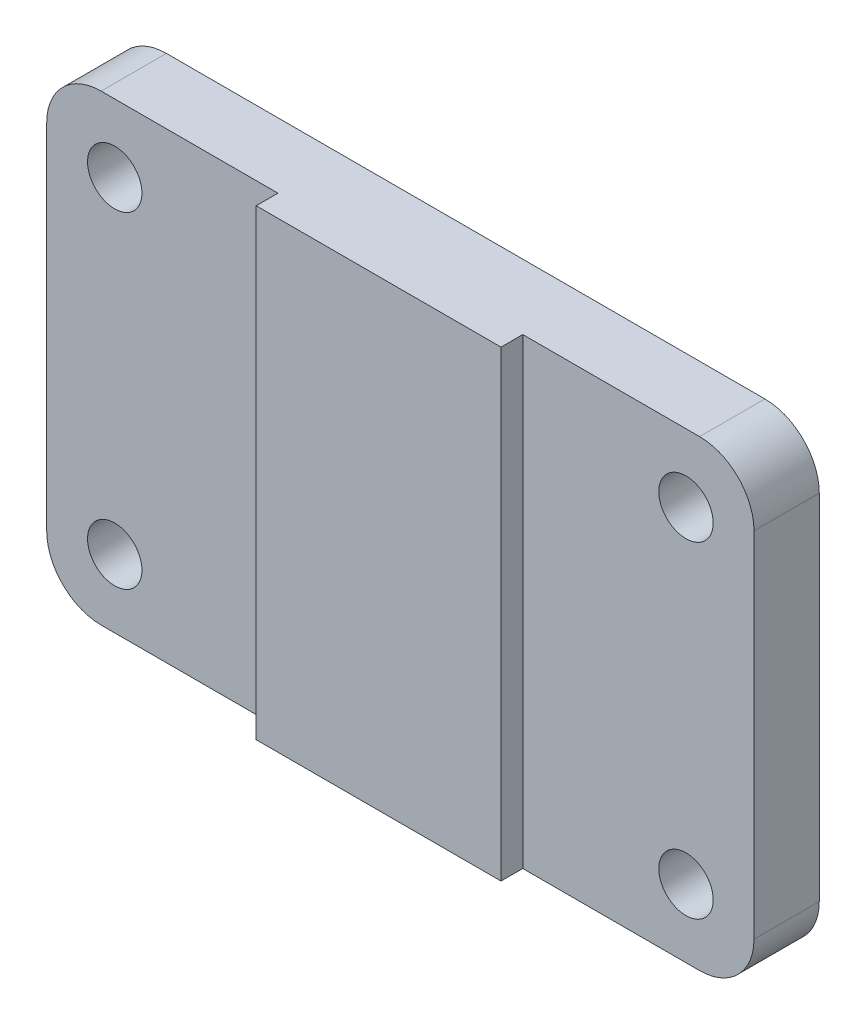
ISO-10303-21;
HEADER;
FILE_DESCRIPTION(('STEP AP214'),'2;1');
FILE_NAME('part.step','',(''),(''),'','','');
FILE_SCHEMA(('AUTOMOTIVE_DESIGN { 1 0 10303 214 1 1 1 1 }'));
ENDSEC;
DATA;
#1=APPLICATION_CONTEXT('core data for automotive mechanical design processes');
#2=APPLICATION_PROTOCOL_DEFINITION('international standard','automotive_design',2000,#1);
#3=PRODUCT_CONTEXT('',#1,'mechanical');
#4=PRODUCT('Part','Part','',(#3));
#5=PRODUCT_RELATED_PRODUCT_CATEGORY('part','',(#4));
#6=PRODUCT_DEFINITION_FORMATION('','',#4);
#7=PRODUCT_DEFINITION_CONTEXT('part definition',#1,'design');
#8=PRODUCT_DEFINITION('design','',#6,#7);
#9=PRODUCT_DEFINITION_SHAPE('','',#8);
#10=(LENGTH_UNIT() NAMED_UNIT(*) SI_UNIT(.MILLI.,.METRE.));
#11=(NAMED_UNIT(*) PLANE_ANGLE_UNIT() SI_UNIT($,.RADIAN.));
#12=(NAMED_UNIT(*) SI_UNIT($,.STERADIAN.) SOLID_ANGLE_UNIT());
#13=UNCERTAINTY_MEASURE_WITH_UNIT(LENGTH_MEASURE(1.E-05),#10,'distance_accuracy_value','');
#14=(GEOMETRIC_REPRESENTATION_CONTEXT(3) GLOBAL_UNCERTAINTY_ASSIGNED_CONTEXT((#13)) GLOBAL_UNIT_ASSIGNED_CONTEXT((#10,
#11,#12)) REPRESENTATION_CONTEXT('',''));
#15=CARTESIAN_POINT('',(0.,0.,0.));
#16=DIRECTION('',(0.,0.,1.));
#17=DIRECTION('',(1.,0.,0.));
#18=AXIS2_PLACEMENT_3D('',#15,#16,#17);
#19=CARTESIAN_POINT('',(22.5,85.,16.));
#20=DIRECTION('',(0.,0.,-1.));
#21=DIRECTION('',(-1.,0.,0.));
#22=AXIS2_PLACEMENT_3D('',#19,#20,#21);
#23=PLANE('',#22);
#24=DIRECTION('',(1.,0.,0.));
#25=VECTOR('',#24,1.);
#26=CARTESIAN_POINT('',(22.5,0.,16.));
#27=LINE('',#26,#25);
#28=CARTESIAN_POINT('',(-22.5,0.,16.));
#29=VERTEX_POINT('',#28);
#30=CARTESIAN_POINT('',(22.5,0.,16.));
#31=VERTEX_POINT('',#30);
#32=EDGE_CURVE('E176',#29,#31,#27,.T.);
#33=ORIENTED_EDGE('',*,*,#32,.T.);
#34=DIRECTION('',(0.,-1.,0.));
#35=VECTOR('',#34,1.);
#36=CARTESIAN_POINT('',(22.5,85.,16.));
#37=LINE('',#36,#35);
#38=CARTESIAN_POINT('',(22.5,85.,16.));
#39=VERTEX_POINT('',#38);
#40=EDGE_CURVE('E204',#39,#31,#37,.T.);
#41=ORIENTED_EDGE('',*,*,#40,.F.);
#42=DIRECTION('',(1.,0.,0.));
#43=VECTOR('',#42,1.);
#44=CARTESIAN_POINT('',(22.5,85.,16.));
#45=LINE('',#44,#43);
#46=CARTESIAN_POINT('',(-22.5,85.,16.));
#47=VERTEX_POINT('',#46);
#48=EDGE_CURVE('E177',#47,#39,#45,.T.);
#49=ORIENTED_EDGE('',*,*,#48,.F.);
#50=DIRECTION('',(0.,-1.,0.));
#51=VECTOR('',#50,1.);
#52=CARTESIAN_POINT('',(-22.5,85.,16.));
#53=LINE('',#52,#51);
#54=EDGE_CURVE('E143',#47,#29,#53,.T.);
#55=ORIENTED_EDGE('',*,*,#54,.T.);
#56=EDGE_LOOP('',(#33,#41,#49,#55));
#57=FACE_BOUND('',#56,.T.);
#58=ADVANCED_FACE('F43',(#57),#23,.F.);
#59=CARTESIAN_POINT('',(22.5,85.,12.));
#60=DIRECTION('',(-1.,0.,0.));
#61=DIRECTION('',(0.,0.,1.));
#62=AXIS2_PLACEMENT_3D('',#59,#60,#61);
#63=PLANE('',#62);
#64=DIRECTION('',(0.,0.,-1.));
#65=VECTOR('',#64,1.);
#66=CARTESIAN_POINT('',(22.5,0.,12.));
#67=LINE('',#66,#65);
#68=CARTESIAN_POINT('',(22.5,0.,12.));
#69=VERTEX_POINT('',#68);
#70=EDGE_CURVE('E189',#31,#69,#67,.T.);
#71=ORIENTED_EDGE('',*,*,#70,.T.);
#72=DIRECTION('',(0.,-1.,0.));
#73=VECTOR('',#72,1.);
#74=CARTESIAN_POINT('',(22.5,85.,12.));
#75=LINE('',#74,#73);
#76=CARTESIAN_POINT('',(22.5,85.,12.));
#77=VERTEX_POINT('',#76);
#78=EDGE_CURVE('E201',#77,#69,#75,.T.);
#79=ORIENTED_EDGE('',*,*,#78,.F.);
#80=DIRECTION('',(0.,0.,-1.));
#81=VECTOR('',#80,1.);
#82=CARTESIAN_POINT('',(22.5,85.,12.));
#83=LINE('',#82,#81);
#84=EDGE_CURVE('E179',#39,#77,#83,.T.);
#85=ORIENTED_EDGE('',*,*,#84,.F.);
#86=ORIENTED_EDGE('',*,*,#40,.T.);
#87=EDGE_LOOP('',(#71,#79,#85,#86));
#88=FACE_BOUND('',#87,.T.);
#89=ADVANCED_FACE('F273',(#88),#63,.F.);
#90=CARTESIAN_POINT('',(65.,85.,12.));
#91=DIRECTION('',(0.,0.,-1.));
#92=DIRECTION('',(-1.,0.,0.));
#93=AXIS2_PLACEMENT_3D('',#90,#91,#92);
#94=PLANE('',#93);
#95=CARTESIAN_POINT('',(52.5,12.5,12.));
#96=DIRECTION('',(0.,0.,1.));
#97=DIRECTION('',(1.,0.,0.));
#98=AXIS2_PLACEMENT_3D('',#95,#96,#97);
#99=CIRCLE('',#98,4.99999999999999);
#100=CARTESIAN_POINT('',(57.5,12.5,12.));
#101=VERTEX_POINT('',#100);
#102=EDGE_CURVE('E164',#101,#101,#99,.T.);
#103=ORIENTED_EDGE('',*,*,#102,.F.);
#104=EDGE_LOOP('',(#103));
#105=FACE_BOUND('',#104,.T.);
#106=CARTESIAN_POINT('',(52.5,72.5,12.));
#107=DIRECTION('',(0.,0.,1.));
#108=DIRECTION('',(1.,0.,0.));
#109=AXIS2_PLACEMENT_3D('',#106,#107,#108);
#110=CIRCLE('',#109,4.99999999999999);
#111=CARTESIAN_POINT('',(57.5,72.5,12.));
#112=VERTEX_POINT('',#111);
#113=EDGE_CURVE('E170',#112,#112,#110,.T.);
#114=ORIENTED_EDGE('',*,*,#113,.F.);
#115=EDGE_LOOP('',(#114));
#116=FACE_BOUND('',#115,.T.);
#117=DIRECTION('',(0.,-1.,0.));
#118=VECTOR('',#117,1.);
#119=CARTESIAN_POINT('',(65.,85.,12.));
#120=LINE('',#119,#118);
#121=CARTESIAN_POINT('',(65.,75.,12.));
#122=VERTEX_POINT('',#121);
#123=CARTESIAN_POINT('',(65.,9.99999999999999,12.));
#124=VERTEX_POINT('',#123);
#125=EDGE_CURVE('E198',#122,#124,#120,.T.);
#126=ORIENTED_EDGE('',*,*,#125,.F.);
#127=CARTESIAN_POINT('',(55.,75.,12.));
#128=DIRECTION('',(0.,0.,-1.));
#129=DIRECTION('',(-1.,0.,0.));
#130=AXIS2_PLACEMENT_3D('',#127,#128,#129);
#131=CIRCLE('',#130,10.);
#132=CARTESIAN_POINT('',(55.,85.,12.));
#133=VERTEX_POINT('',#132);
#134=EDGE_CURVE('E221',#122,#133,#131,.F.);
#135=ORIENTED_EDGE('',*,*,#134,.T.);
#136=DIRECTION('',(1.,0.,0.));
#137=VECTOR('',#136,1.);
#138=CARTESIAN_POINT('',(65.,85.,12.));
#139=LINE('',#138,#137);
#140=EDGE_CURVE('E182',#77,#133,#139,.T.);
#141=ORIENTED_EDGE('',*,*,#140,.F.);
#142=ORIENTED_EDGE('',*,*,#78,.T.);
#143=DIRECTION('',(1.,0.,0.));
#144=VECTOR('',#143,1.);
#145=CARTESIAN_POINT('',(65.,0.,12.));
#146=LINE('',#145,#144);
#147=CARTESIAN_POINT('',(55.,0.,12.));
#148=VERTEX_POINT('',#147);
#149=EDGE_CURVE('E191',#69,#148,#146,.T.);
#150=ORIENTED_EDGE('',*,*,#149,.T.);
#151=CARTESIAN_POINT('',(55.,9.99999999999999,12.));
#152=DIRECTION('',(0.,0.,-1.));
#153=DIRECTION('',(-1.,0.,0.));
#154=AXIS2_PLACEMENT_3D('',#151,#152,#153);
#155=CIRCLE('',#154,10.);
#156=EDGE_CURVE('E219',#148,#124,#155,.F.);
#157=ORIENTED_EDGE('',*,*,#156,.T.);
#158=EDGE_LOOP('',(#126,#135,#141,#142,#150,#157));
#159=FACE_BOUND('',#158,.T.);
#160=ADVANCED_FACE('F279',(#105,#116,#159),#94,.F.);
#161=CARTESIAN_POINT('',(65.,85.,0.));
#162=DIRECTION('',(-1.,0.,0.));
#163=DIRECTION('',(0.,0.,1.));
#164=AXIS2_PLACEMENT_3D('',#161,#162,#163);
#165=PLANE('',#164);
#166=DIRECTION('',(0.,-1.,0.));
#167=VECTOR('',#166,1.);
#168=CARTESIAN_POINT('',(65.,85.,0.));
#169=LINE('',#168,#167);
#170=CARTESIAN_POINT('',(65.,75.,0.));
#171=VERTEX_POINT('',#170);
#172=CARTESIAN_POINT('',(65.,9.99999999999999,0.));
#173=VERTEX_POINT('',#172);
#174=EDGE_CURVE('E187',#171,#173,#169,.T.);
#175=ORIENTED_EDGE('',*,*,#174,.F.);
#176=DIRECTION('',(0.,0.,-1.));
#177=VECTOR('',#176,1.);
#178=CARTESIAN_POINT('',(65.,75.,0.));
#179=LINE('',#178,#177);
#180=EDGE_CURVE('E217',#171,#122,#179,.F.);
#181=ORIENTED_EDGE('',*,*,#180,.T.);
#182=ORIENTED_EDGE('',*,*,#125,.T.);
#183=DIRECTION('',(0.,0.,-1.));
#184=VECTOR('',#183,1.);
#185=CARTESIAN_POINT('',(65.,9.99999999999999,0.));
#186=LINE('',#185,#184);
#187=EDGE_CURVE('E214',#124,#173,#186,.T.);
#188=ORIENTED_EDGE('',*,*,#187,.T.);
#189=EDGE_LOOP('',(#175,#181,#182,#188));
#190=FACE_BOUND('',#189,.T.);
#191=ADVANCED_FACE('F254',(#190),#165,.F.);
#192=CARTESIAN_POINT('',(0.,85.,0.));
#193=DIRECTION('',(0.,0.,1.));
#194=DIRECTION('',(1.,0.,0.));
#195=AXIS2_PLACEMENT_3D('',#192,#193,#194);
#196=PLANE('',#195);
#197=CARTESIAN_POINT('',(-52.5,12.5,0.));
#198=DIRECTION('',(0.,0.,1.));
#199=DIRECTION('',(1.,0.,0.));
#200=AXIS2_PLACEMENT_3D('',#197,#198,#199);
#201=CIRCLE('',#200,5.);
#202=CARTESIAN_POINT('',(-47.5,12.5,0.));
#203=VERTEX_POINT('',#202);
#204=EDGE_CURVE('E521',#203,#203,#201,.T.);
#205=ORIENTED_EDGE('',*,*,#204,.T.);
#206=EDGE_LOOP('',(#205));
#207=FACE_BOUND('',#206,.T.);
#208=CARTESIAN_POINT('',(-52.5,72.5,0.));
#209=DIRECTION('',(0.,0.,1.));
#210=DIRECTION('',(1.,0.,0.));
#211=AXIS2_PLACEMENT_3D('',#208,#209,#210);
#212=CIRCLE('',#211,5.);
#213=CARTESIAN_POINT('',(-47.5,72.5,0.));
#214=VERTEX_POINT('',#213);
#215=EDGE_CURVE('E158',#214,#214,#212,.T.);
#216=ORIENTED_EDGE('',*,*,#215,.T.);
#217=EDGE_LOOP('',(#216));
#218=FACE_BOUND('',#217,.T.);
#219=CARTESIAN_POINT('',(52.5,12.5,0.));
#220=DIRECTION('',(0.,0.,1.));
#221=DIRECTION('',(1.,0.,0.));
#222=AXIS2_PLACEMENT_3D('',#219,#220,#221);
#223=CIRCLE('',#222,5.);
#224=CARTESIAN_POINT('',(57.5,12.5,0.));
#225=VERTEX_POINT('',#224);
#226=EDGE_CURVE('E167',#225,#225,#223,.T.);
#227=ORIENTED_EDGE('',*,*,#226,.T.);
#228=EDGE_LOOP('',(#227));
#229=FACE_BOUND('',#228,.T.);
#230=CARTESIAN_POINT('',(52.5,72.5,0.));
#231=DIRECTION('',(0.,0.,1.));
#232=DIRECTION('',(1.,0.,0.));
#233=AXIS2_PLACEMENT_3D('',#230,#231,#232);
#234=CIRCLE('',#233,5.);
#235=CARTESIAN_POINT('',(57.5,72.5,0.));
#236=VERTEX_POINT('',#235);
#237=EDGE_CURVE('E173',#236,#236,#234,.T.);
#238=ORIENTED_EDGE('',*,*,#237,.T.);
#239=EDGE_LOOP('',(#238));
#240=FACE_BOUND('',#239,.T.);
#241=DIRECTION('',(0.,-1.,0.));
#242=VECTOR('',#241,1.);
#243=CARTESIAN_POINT('',(-65.,85.,0.));
#244=LINE('',#243,#242);
#245=CARTESIAN_POINT('',(-65.,75.,0.));
#246=VERTEX_POINT('',#245);
#247=CARTESIAN_POINT('',(-65.,9.99999999999999,0.));
#248=VERTEX_POINT('',#247);
#249=EDGE_CURVE('E161',#246,#248,#244,.T.);
#250=ORIENTED_EDGE('',*,*,#249,.F.);
#251=CARTESIAN_POINT('',(-55.,75.,0.));
#252=DIRECTION('',(0.,0.,1.));
#253=DIRECTION('',(1.,0.,0.));
#254=AXIS2_PLACEMENT_3D('',#251,#252,#253);
#255=CIRCLE('',#254,10.);
#256=CARTESIAN_POINT('',(-55.,85.,0.));
#257=VERTEX_POINT('',#256);
#258=EDGE_CURVE('E232',#246,#257,#255,.F.);
#259=ORIENTED_EDGE('',*,*,#258,.T.);
#260=DIRECTION('',(-1.,0.,0.));
#261=VECTOR('',#260,1.);
#262=CARTESIAN_POINT('',(0.,85.,0.));
#263=LINE('',#262,#261);
#264=CARTESIAN_POINT('',(55.,85.,0.));
#265=VERTEX_POINT('',#264);
#266=EDGE_CURVE('E185',#265,#257,#263,.T.);
#267=ORIENTED_EDGE('',*,*,#266,.F.);
#268=CARTESIAN_POINT('',(55.,75.,0.));
#269=DIRECTION('',(0.,0.,1.));
#270=DIRECTION('',(1.,0.,0.));
#271=AXIS2_PLACEMENT_3D('',#268,#269,#270);
#272=CIRCLE('',#271,10.);
#273=EDGE_CURVE('E212',#265,#171,#272,.F.);
#274=ORIENTED_EDGE('',*,*,#273,.T.);
#275=ORIENTED_EDGE('',*,*,#174,.T.);
#276=CARTESIAN_POINT('',(55.,9.99999999999999,0.));
#277=DIRECTION('',(0.,0.,1.));
#278=DIRECTION('',(1.,0.,0.));
#279=AXIS2_PLACEMENT_3D('',#276,#277,#278);
#280=CIRCLE('',#279,10.);
#281=CARTESIAN_POINT('',(55.,0.,0.));
#282=VERTEX_POINT('',#281);
#283=EDGE_CURVE('E210',#173,#282,#280,.F.);
#284=ORIENTED_EDGE('',*,*,#283,.T.);
#285=DIRECTION('',(-1.,0.,0.));
#286=VECTOR('',#285,1.);
#287=CARTESIAN_POINT('',(0.,0.,0.));
#288=LINE('',#287,#286);
#289=CARTESIAN_POINT('',(-55.,0.,0.));
#290=VERTEX_POINT('',#289);
#291=EDGE_CURVE('E180',#282,#290,#288,.T.);
#292=ORIENTED_EDGE('',*,*,#291,.T.);
#293=CARTESIAN_POINT('',(-55.,10.,0.));
#294=DIRECTION('',(0.,0.,1.));
#295=DIRECTION('',(1.,0.,0.));
#296=AXIS2_PLACEMENT_3D('',#293,#294,#295);
#297=CIRCLE('',#296,10.);
#298=EDGE_CURVE('E230',#290,#248,#297,.F.);
#299=ORIENTED_EDGE('',*,*,#298,.T.);
#300=EDGE_LOOP('',(#250,#259,#267,#274,#275,#284,#292,#299));
#301=FACE_BOUND('',#300,.T.);
#302=ADVANCED_FACE('F245',(#207,#218,#229,#240,#301),#196,.F.);
#303=CARTESIAN_POINT('',(0.,85.,0.));
#304=DIRECTION('',(0.,-1.,0.));
#305=DIRECTION('',(0.,0.,-1.));
#306=AXIS2_PLACEMENT_3D('',#303,#304,#305);
#307=PLANE('',#306);
#308=ORIENTED_EDGE('',*,*,#266,.T.);
#309=DIRECTION('',(0.,0.,-1.));
#310=VECTOR('',#309,1.);
#311=CARTESIAN_POINT('',(-55.,85.,12.));
#312=LINE('',#311,#310);
#313=CARTESIAN_POINT('',(-55.,85.,12.));
#314=VERTEX_POINT('',#313);
#315=EDGE_CURVE('E66',#257,#314,#312,.F.);
#316=ORIENTED_EDGE('',*,*,#315,.T.);
#317=DIRECTION('',(-1.,0.,0.));
#318=VECTOR('',#317,1.);
#319=CARTESIAN_POINT('',(-65.,85.,12.));
#320=LINE('',#319,#318);
#321=CARTESIAN_POINT('',(-22.5,85.,12.));
#322=VERTEX_POINT('',#321);
#323=EDGE_CURVE('E135',#322,#314,#320,.T.);
#324=ORIENTED_EDGE('',*,*,#323,.F.);
#325=DIRECTION('',(0.,0.,-1.));
#326=VECTOR('',#325,1.);
#327=CARTESIAN_POINT('',(-22.5,85.,12.));
#328=LINE('',#327,#326);
#329=EDGE_CURVE('E147',#47,#322,#328,.T.);
#330=ORIENTED_EDGE('',*,*,#329,.F.);
#331=ORIENTED_EDGE('',*,*,#48,.T.);
#332=ORIENTED_EDGE('',*,*,#84,.T.);
#333=ORIENTED_EDGE('',*,*,#140,.T.);
#334=DIRECTION('',(0.,0.,-1.));
#335=VECTOR('',#334,1.);
#336=CARTESIAN_POINT('',(55.,85.,0.));
#337=LINE('',#336,#335);
#338=EDGE_CURVE('E207',#133,#265,#337,.T.);
#339=ORIENTED_EDGE('',*,*,#338,.T.);
#340=EDGE_LOOP('',(#308,#316,#324,#330,#331,#332,#333,#339));
#341=FACE_BOUND('',#340,.T.);
#342=ADVANCED_FACE('F146',(#341),#307,.F.);
#343=CARTESIAN_POINT('',(0.,0.,0.));
#344=DIRECTION('',(0.,-1.,0.));
#345=DIRECTION('',(0.,0.,-1.));
#346=AXIS2_PLACEMENT_3D('',#343,#344,#345);
#347=PLANE('',#346);
#348=DIRECTION('',(-1.,0.,0.));
#349=VECTOR('',#348,1.);
#350=CARTESIAN_POINT('',(-65.,0.,12.));
#351=LINE('',#350,#349);
#352=CARTESIAN_POINT('',(-22.5,0.,12.));
#353=VERTEX_POINT('',#352);
#354=CARTESIAN_POINT('',(-55.,0.,12.));
#355=VERTEX_POINT('',#354);
#356=EDGE_CURVE('E137',#353,#355,#351,.T.);
#357=ORIENTED_EDGE('',*,*,#356,.T.);
#358=DIRECTION('',(0.,0.,-1.));
#359=VECTOR('',#358,1.);
#360=CARTESIAN_POINT('',(-55.,0.,0.));
#361=LINE('',#360,#359);
#362=EDGE_CURVE('E11',#355,#290,#361,.T.);
#363=ORIENTED_EDGE('',*,*,#362,.T.);
#364=ORIENTED_EDGE('',*,*,#291,.F.);
#365=DIRECTION('',(0.,0.,-1.));
#366=VECTOR('',#365,1.);
#367=CARTESIAN_POINT('',(55.,0.,12.));
#368=LINE('',#367,#366);
#369=EDGE_CURVE('E223',#282,#148,#368,.F.);
#370=ORIENTED_EDGE('',*,*,#369,.T.);
#371=ORIENTED_EDGE('',*,*,#149,.F.);
#372=ORIENTED_EDGE('',*,*,#70,.F.);
#373=ORIENTED_EDGE('',*,*,#32,.F.);
#374=DIRECTION('',(0.,0.,-1.));
#375=VECTOR('',#374,1.);
#376=CARTESIAN_POINT('',(-22.5,0.,12.));
#377=LINE('',#376,#375);
#378=EDGE_CURVE('E148',#29,#353,#377,.T.);
#379=ORIENTED_EDGE('',*,*,#378,.T.);
#380=EDGE_LOOP('',(#357,#363,#364,#370,#371,#372,#373,#379));
#381=FACE_BOUND('',#380,.T.);
#382=ADVANCED_FACE('F263',(#381),#347,.T.);
#383=CARTESIAN_POINT('',(52.5,72.5,12.));
#384=DIRECTION('',(0.,0.,1.));
#385=DIRECTION('',(1.,0.,0.));
#386=AXIS2_PLACEMENT_3D('',#383,#384,#385);
#387=CYLINDRICAL_SURFACE('',#386,4.99999999999999);
#388=ORIENTED_EDGE('',*,*,#237,.F.);
#389=EDGE_LOOP('',(#388));
#390=FACE_BOUND('',#389,.T.);
#391=ORIENTED_EDGE('',*,*,#113,.T.);
#392=EDGE_LOOP('',(#391));
#393=FACE_BOUND('',#392,.T.);
#394=ADVANCED_FACE('F301',(#390,#393),#387,.F.);
#395=CARTESIAN_POINT('',(52.5,12.5,12.));
#396=DIRECTION('',(0.,0.,1.));
#397=DIRECTION('',(1.,0.,0.));
#398=AXIS2_PLACEMENT_3D('',#395,#396,#397);
#399=CYLINDRICAL_SURFACE('',#398,4.99999999999999);
#400=ORIENTED_EDGE('',*,*,#226,.F.);
#401=EDGE_LOOP('',(#400));
#402=FACE_BOUND('',#401,.T.);
#403=ORIENTED_EDGE('',*,*,#102,.T.);
#404=EDGE_LOOP('',(#403));
#405=FACE_BOUND('',#404,.T.);
#406=ADVANCED_FACE('F286',(#402,#405),#399,.F.);
#407=CARTESIAN_POINT('',(55.,75.,0.));
#408=DIRECTION('',(0.,0.,-1.));
#409=DIRECTION('',(-1.,0.,0.));
#410=AXIS2_PLACEMENT_3D('',#407,#408,#409);
#411=CYLINDRICAL_SURFACE('',#410,10.);
#412=ORIENTED_EDGE('',*,*,#134,.F.);
#413=ORIENTED_EDGE('',*,*,#180,.F.);
#414=ORIENTED_EDGE('',*,*,#273,.F.);
#415=ORIENTED_EDGE('',*,*,#338,.F.);
#416=EDGE_LOOP('',(#412,#413,#414,#415));
#417=FACE_BOUND('',#416,.T.);
#418=ADVANCED_FACE('F250',(#417),#411,.T.);
#419=CARTESIAN_POINT('',(55.,9.99999999999999,0.));
#420=DIRECTION('',(0.,0.,1.));
#421=DIRECTION('',(1.,0.,0.));
#422=AXIS2_PLACEMENT_3D('',#419,#420,#421);
#423=CYLINDRICAL_SURFACE('',#422,10.);
#424=ORIENTED_EDGE('',*,*,#156,.F.);
#425=ORIENTED_EDGE('',*,*,#369,.F.);
#426=ORIENTED_EDGE('',*,*,#283,.F.);
#427=ORIENTED_EDGE('',*,*,#187,.F.);
#428=EDGE_LOOP('',(#424,#425,#426,#427));
#429=FACE_BOUND('',#428,.T.);
#430=ADVANCED_FACE('F259',(#429),#423,.T.);
#431=CARTESIAN_POINT('',(-65.,85.,0.));
#432=DIRECTION('',(-1.,0.,0.));
#433=DIRECTION('',(0.,0.,1.));
#434=AXIS2_PLACEMENT_3D('',#431,#432,#433);
#435=PLANE('',#434);
#436=DIRECTION('',(0.,-1.,0.));
#437=VECTOR('',#436,1.);
#438=CARTESIAN_POINT('',(-65.,85.,12.));
#439=LINE('',#438,#437);
#440=CARTESIAN_POINT('',(-65.,75.,12.));
#441=VERTEX_POINT('',#440);
#442=CARTESIAN_POINT('',(-65.,9.99999999999999,12.));
#443=VERTEX_POINT('',#442);
#444=EDGE_CURVE('E142',#441,#443,#439,.T.);
#445=ORIENTED_EDGE('',*,*,#444,.F.);
#446=DIRECTION('',(0.,0.,-1.));
#447=VECTOR('',#446,1.);
#448=CARTESIAN_POINT('',(-65.,75.,0.));
#449=LINE('',#448,#447);
#450=EDGE_CURVE('E227',#441,#246,#449,.T.);
#451=ORIENTED_EDGE('',*,*,#450,.T.);
#452=ORIENTED_EDGE('',*,*,#249,.T.);
#453=DIRECTION('',(0.,0.,-1.));
#454=VECTOR('',#453,1.);
#455=CARTESIAN_POINT('',(-65.,9.99999999999999,0.));
#456=LINE('',#455,#454);
#457=EDGE_CURVE('E225',#248,#443,#456,.F.);
#458=ORIENTED_EDGE('',*,*,#457,.T.);
#459=EDGE_LOOP('',(#445,#451,#452,#458));
#460=FACE_BOUND('',#459,.T.);
#461=ADVANCED_FACE('F239',(#460),#435,.T.);
#462=CARTESIAN_POINT('',(-65.,85.,12.));
#463=DIRECTION('',(0.,0.,1.));
#464=DIRECTION('',(1.,0.,0.));
#465=AXIS2_PLACEMENT_3D('',#462,#463,#464);
#466=PLANE('',#465);
#467=CARTESIAN_POINT('',(-52.5,12.5,12.));
#468=DIRECTION('',(0.,0.,1.));
#469=DIRECTION('',(1.,0.,0.));
#470=AXIS2_PLACEMENT_3D('',#467,#468,#469);
#471=CIRCLE('',#470,4.99999999999999);
#472=CARTESIAN_POINT('',(-47.5,12.5,12.));
#473=VERTEX_POINT('',#472);
#474=EDGE_CURVE('E524',#473,#473,#471,.T.);
#475=ORIENTED_EDGE('',*,*,#474,.F.);
#476=EDGE_LOOP('',(#475));
#477=FACE_BOUND('',#476,.T.);
#478=CARTESIAN_POINT('',(-52.5,72.5,12.));
#479=DIRECTION('',(0.,0.,1.));
#480=DIRECTION('',(1.,0.,0.));
#481=AXIS2_PLACEMENT_3D('',#478,#479,#480);
#482=CIRCLE('',#481,4.99999999999999);
#483=CARTESIAN_POINT('',(-47.5,72.5,12.));
#484=VERTEX_POINT('',#483);
#485=EDGE_CURVE('E526',#484,#484,#482,.T.);
#486=ORIENTED_EDGE('',*,*,#485,.F.);
#487=EDGE_LOOP('',(#486));
#488=FACE_BOUND('',#487,.T.);
#489=ORIENTED_EDGE('',*,*,#323,.T.);
#490=CARTESIAN_POINT('',(-55.,75.,12.));
#491=DIRECTION('',(0.,0.,1.));
#492=DIRECTION('',(1.,0.,0.));
#493=AXIS2_PLACEMENT_3D('',#490,#491,#492);
#494=CIRCLE('',#493,10.);
#495=EDGE_CURVE('E51',#314,#441,#494,.T.);
#496=ORIENTED_EDGE('',*,*,#495,.T.);
#497=ORIENTED_EDGE('',*,*,#444,.T.);
#498=CARTESIAN_POINT('',(-55.,10.,12.));
#499=DIRECTION('',(0.,0.,1.));
#500=DIRECTION('',(1.,0.,0.));
#501=AXIS2_PLACEMENT_3D('',#498,#499,#500);
#502=CIRCLE('',#501,10.);
#503=EDGE_CURVE('E58',#443,#355,#502,.T.);
#504=ORIENTED_EDGE('',*,*,#503,.T.);
#505=ORIENTED_EDGE('',*,*,#356,.F.);
#506=DIRECTION('',(0.,-1.,0.));
#507=VECTOR('',#506,1.);
#508=CARTESIAN_POINT('',(-22.5,85.,12.));
#509=LINE('',#508,#507);
#510=EDGE_CURVE('E133',#322,#353,#509,.T.);
#511=ORIENTED_EDGE('',*,*,#510,.F.);
#512=EDGE_LOOP('',(#489,#496,#497,#504,#505,#511));
#513=FACE_BOUND('',#512,.T.);
#514=ADVANCED_FACE('F134',(#477,#488,#513),#466,.T.);
#515=CARTESIAN_POINT('',(-22.5,85.,12.));
#516=DIRECTION('',(-1.,0.,0.));
#517=DIRECTION('',(0.,0.,1.));
#518=AXIS2_PLACEMENT_3D('',#515,#516,#517);
#519=PLANE('',#518);
#520=ORIENTED_EDGE('',*,*,#378,.F.);
#521=ORIENTED_EDGE('',*,*,#54,.F.);
#522=ORIENTED_EDGE('',*,*,#329,.T.);
#523=ORIENTED_EDGE('',*,*,#510,.T.);
#524=EDGE_LOOP('',(#520,#521,#522,#523));
#525=FACE_BOUND('',#524,.T.);
#526=ADVANCED_FACE('F151',(#525),#519,.T.);
#527=CARTESIAN_POINT('',(-52.5,72.5,12.));
#528=DIRECTION('',(0.,0.,1.));
#529=DIRECTION('',(1.,0.,0.));
#530=AXIS2_PLACEMENT_3D('',#527,#528,#529);
#531=CYLINDRICAL_SURFACE('',#530,4.99999999999999);
#532=ORIENTED_EDGE('',*,*,#215,.F.);
#533=EDGE_LOOP('',(#532));
#534=FACE_BOUND('',#533,.T.);
#535=ORIENTED_EDGE('',*,*,#485,.T.);
#536=EDGE_LOOP('',(#535));
#537=FACE_BOUND('',#536,.T.);
#538=ADVANCED_FACE('F382',(#534,#537),#531,.F.);
#539=CARTESIAN_POINT('',(-52.5,12.5,12.));
#540=DIRECTION('',(0.,0.,1.));
#541=DIRECTION('',(1.,0.,0.));
#542=AXIS2_PLACEMENT_3D('',#539,#540,#541);
#543=CYLINDRICAL_SURFACE('',#542,4.99999999999999);
#544=ORIENTED_EDGE('',*,*,#204,.F.);
#545=EDGE_LOOP('',(#544));
#546=FACE_BOUND('',#545,.T.);
#547=ORIENTED_EDGE('',*,*,#474,.T.);
#548=EDGE_LOOP('',(#547));
#549=FACE_BOUND('',#548,.T.);
#550=ADVANCED_FACE('F271',(#546,#549),#543,.F.);
#551=CARTESIAN_POINT('',(-55.,75.,0.));
#552=DIRECTION('',(0.,0.,1.));
#553=DIRECTION('',(1.,0.,0.));
#554=AXIS2_PLACEMENT_3D('',#551,#552,#553);
#555=CYLINDRICAL_SURFACE('',#554,10.);
#556=ORIENTED_EDGE('',*,*,#495,.F.);
#557=ORIENTED_EDGE('',*,*,#315,.F.);
#558=ORIENTED_EDGE('',*,*,#258,.F.);
#559=ORIENTED_EDGE('',*,*,#450,.F.);
#560=EDGE_LOOP('',(#556,#557,#558,#559));
#561=FACE_BOUND('',#560,.T.);
#562=ADVANCED_FACE('F242',(#561),#555,.T.);
#563=CARTESIAN_POINT('',(-55.,10.,0.));
#564=DIRECTION('',(0.,0.,-1.));
#565=DIRECTION('',(-1.,0.,0.));
#566=AXIS2_PLACEMENT_3D('',#563,#564,#565);
#567=CYLINDRICAL_SURFACE('',#566,10.);
#568=ORIENTED_EDGE('',*,*,#503,.F.);
#569=ORIENTED_EDGE('',*,*,#457,.F.);
#570=ORIENTED_EDGE('',*,*,#298,.F.);
#571=ORIENTED_EDGE('',*,*,#362,.F.);
#572=EDGE_LOOP('',(#568,#569,#570,#571));
#573=FACE_BOUND('',#572,.T.);
#574=ADVANCED_FACE('F45',(#573),#567,.T.);
#575=CLOSED_SHELL('',(#58,#89,#160,#191,#302,#342,#382,#394,#406,#418,#430,#461,#514,#526,#538,
#550,#562,#574));
#576=MANIFOLD_SOLID_BREP('B2',#575);
#577=ADVANCED_BREP_SHAPE_REPRESENTATION('',(#18,#576),#14);
#578=SHAPE_DEFINITION_REPRESENTATION(#9,#577);
ENDSEC;
END-ISO-10303-21;
